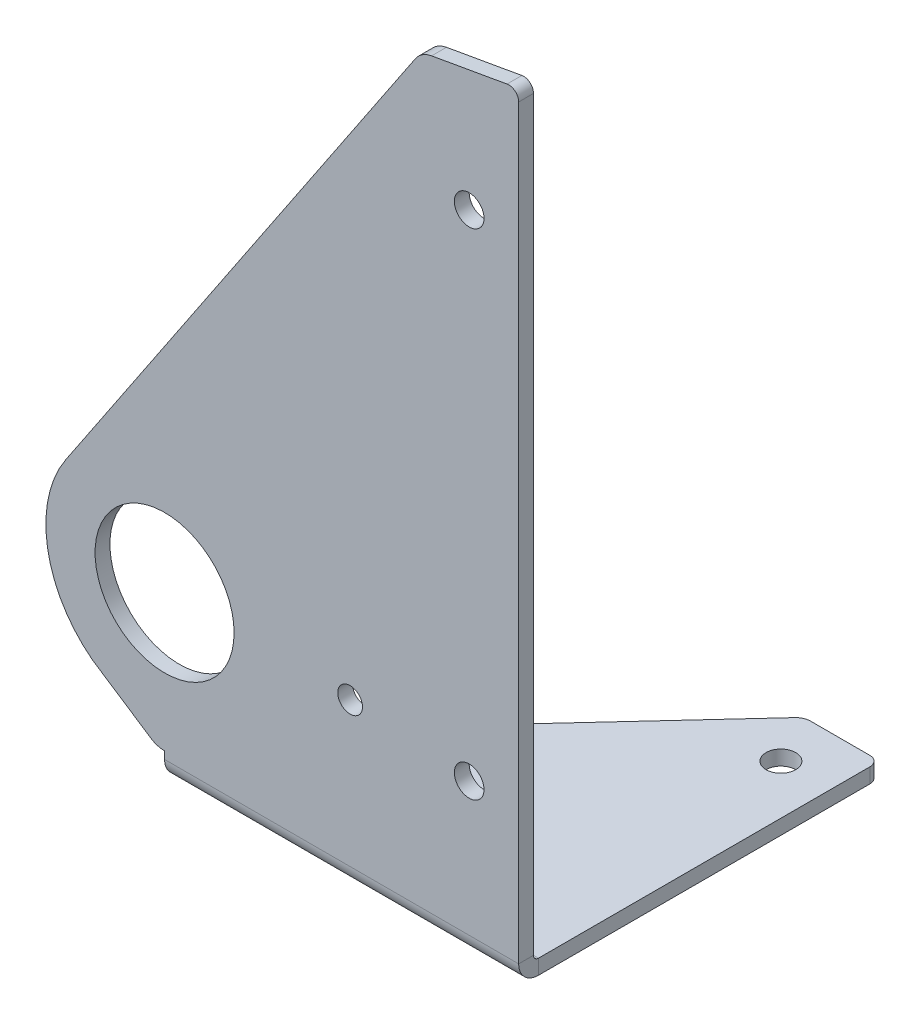
ISO-10303-21;
HEADER;
FILE_DESCRIPTION(('STEP AP214'),'2;1');
FILE_NAME('part.step','',(''),(''),'','','');
FILE_SCHEMA(('AUTOMOTIVE_DESIGN { 1 0 10303 214 1 1 1 1 }'));
ENDSEC;
DATA;
#1=APPLICATION_CONTEXT('core data for automotive mechanical design processes');
#2=APPLICATION_PROTOCOL_DEFINITION('international standard','automotive_design',2000,#1);
#3=PRODUCT_CONTEXT('',#1,'mechanical');
#4=PRODUCT('Part','Part','',(#3));
#5=PRODUCT_RELATED_PRODUCT_CATEGORY('part','',(#4));
#6=PRODUCT_DEFINITION_FORMATION('','',#4);
#7=PRODUCT_DEFINITION_CONTEXT('part definition',#1,'design');
#8=PRODUCT_DEFINITION('design','',#6,#7);
#9=PRODUCT_DEFINITION_SHAPE('','',#8);
#10=(LENGTH_UNIT() NAMED_UNIT(*) SI_UNIT(.MILLI.,.METRE.));
#11=(NAMED_UNIT(*) PLANE_ANGLE_UNIT() SI_UNIT($,.RADIAN.));
#12=(NAMED_UNIT(*) SI_UNIT($,.STERADIAN.) SOLID_ANGLE_UNIT());
#13=UNCERTAINTY_MEASURE_WITH_UNIT(LENGTH_MEASURE(1.E-05),#10,'distance_accuracy_value','');
#14=(GEOMETRIC_REPRESENTATION_CONTEXT(3) GLOBAL_UNCERTAINTY_ASSIGNED_CONTEXT((#13)) GLOBAL_UNIT_ASSIGNED_CONTEXT((#10,
#11,#12)) REPRESENTATION_CONTEXT('',''));
#15=CARTESIAN_POINT('',(0.,0.,0.));
#16=DIRECTION('',(0.,0.,1.));
#17=DIRECTION('',(1.,0.,0.));
#18=AXIS2_PLACEMENT_3D('',#15,#16,#17);
#19=CARTESIAN_POINT('',(0.,0.,3.));
#20=DIRECTION('',(0.,0.,1.));
#21=DIRECTION('',(1.,0.,0.));
#22=AXIS2_PLACEMENT_3D('',#19,#20,#21);
#23=PLANE('',#22);
#24=CARTESIAN_POINT('',(624.785,479.124016715,3.));
#25=DIRECTION('',(0.,0.,1.));
#26=DIRECTION('',(1.,0.,0.));
#27=AXIS2_PLACEMENT_3D('',#24,#25,#26);
#28=CIRCLE('',#27,3.00000000000005);
#29=CARTESIAN_POINT('',(627.785,479.124016715,3.));
#30=VERTEX_POINT('',#29);
#31=EDGE_CURVE('E349',#30,#30,#28,.T.);
#32=ORIENTED_EDGE('',*,*,#31,.F.);
#33=EDGE_LOOP('',(#32));
#34=FACE_BOUND('',#33,.T.);
#35=CARTESIAN_POINT('',(600.715,381.314016715,3.));
#36=DIRECTION('',(0.,0.,1.));
#37=DIRECTION('',(1.,0.,0.));
#38=AXIS2_PLACEMENT_3D('',#35,#36,#37);
#39=CIRCLE('',#38,2.49999999999995);
#40=CARTESIAN_POINT('',(603.215,381.314016715,3.));
#41=VERTEX_POINT('',#40);
#42=EDGE_CURVE('E195',#41,#41,#39,.T.);
#43=ORIENTED_EDGE('',*,*,#42,.F.);
#44=EDGE_LOOP('',(#43));
#45=FACE_BOUND('',#44,.T.);
#46=CARTESIAN_POINT('',(563.215,381.314016715,3.));
#47=DIRECTION('',(0.,0.,1.));
#48=DIRECTION('',(1.,0.,0.));
#49=AXIS2_PLACEMENT_3D('',#46,#47,#48);
#50=CIRCLE('',#49,14.05);
#51=CARTESIAN_POINT('',(577.265,381.314016715,3.));
#52=VERTEX_POINT('',#51);
#53=EDGE_CURVE('E201',#52,#52,#50,.T.);
#54=ORIENTED_EDGE('',*,*,#53,.F.);
#55=EDGE_LOOP('',(#54));
#56=FACE_BOUND('',#55,.T.);
#57=CARTESIAN_POINT('',(624.785,379.124016715,3.));
#58=DIRECTION('',(0.,0.,1.));
#59=DIRECTION('',(1.,0.,0.));
#60=AXIS2_PLACEMENT_3D('',#57,#58,#59);
#61=CIRCLE('',#60,3.);
#62=CARTESIAN_POINT('',(627.785,379.124016715,3.));
#63=VERTEX_POINT('',#62);
#64=EDGE_CURVE('E378',#63,#63,#61,.T.);
#65=ORIENTED_EDGE('',*,*,#64,.F.);
#66=EDGE_LOOP('',(#65));
#67=FACE_BOUND('',#66,.T.);
#68=DIRECTION('',(-0.834861498321892,0.550460060876105,0.));
#69=VECTOR('',#68,1.);
#70=CARTESIAN_POINT('',(332.713886262824,504.614291463374,3.));
#71=LINE('',#70,#69);
#72=CARTESIAN_POINT('',(560.462704086631,354.449709223391,3.));
#73=VERTEX_POINT('',#72);
#74=CARTESIAN_POINT('',(548.655279811411,362.234851427687,3.));
#75=VERTEX_POINT('',#74);
#76=EDGE_CURVE('E179',#73,#75,#71,.T.);
#77=ORIENTED_EDGE('',*,*,#76,.F.);
#78=CARTESIAN_POINT('',(563.215004391011,358.624016715,3.));
#79=DIRECTION('',(0.,0.,1.));
#80=DIRECTION('',(1.,0.,0.));
#81=AXIS2_PLACEMENT_3D('',#78,#79,#80);
#82=CIRCLE('',#81,5.);
#83=CARTESIAN_POINT('',(563.215,353.624016715,3.));
#84=VERTEX_POINT('',#83);
#85=EDGE_CURVE('E58',#73,#84,#82,.T.);
#86=ORIENTED_EDGE('',*,*,#85,.T.);
#87=DIRECTION('',(0.,1.,0.));
#88=VECTOR('',#87,1.);
#89=CARTESIAN_POINT('',(563.215,0.,3.));
#90=LINE('',#89,#88);
#91=CARTESIAN_POINT('',(563.215,352.12401671482,3.));
#92=VERTEX_POINT('',#91);
#93=EDGE_CURVE('E372',#84,#92,#90,.F.);
#94=ORIENTED_EDGE('',*,*,#93,.T.);
#95=DIRECTION('',(1.,0.,0.));
#96=VECTOR('',#95,1.);
#97=CARTESIAN_POINT('',(0.,352.12401671482,3.));
#98=LINE('',#97,#96);
#99=CARTESIAN_POINT('',(634.785,352.12401671482,3.));
#100=VERTEX_POINT('',#99);
#101=EDGE_CURVE('E377',#92,#100,#98,.T.);
#102=ORIENTED_EDGE('',*,*,#101,.T.);
#103=DIRECTION('',(0.,1.,0.));
#104=VECTOR('',#103,1.);
#105=CARTESIAN_POINT('',(634.785,0.,3.));
#106=LINE('',#105,#104);
#107=CARTESIAN_POINT('',(634.785,503.002476101812,3.));
#108=VERTEX_POINT('',#107);
#109=EDGE_CURVE('E479',#100,#108,#106,.T.);
#110=ORIENTED_EDGE('',*,*,#109,.T.);
#111=CARTESIAN_POINT('',(632.785,503.002476101812,3.));
#112=DIRECTION('',(0.,0.,1.));
#113=DIRECTION('',(1.,0.,0.));
#114=AXIS2_PLACEMENT_3D('',#111,#112,#113);
#115=CIRCLE('',#114,2.);
#116=CARTESIAN_POINT('',(632.437703644666,504.972091607836,3.));
#117=VERTEX_POINT('',#116);
#118=EDGE_CURVE('E361',#108,#117,#115,.T.);
#119=ORIENTED_EDGE('',*,*,#118,.T.);
#120=DIRECTION('',(0.984807753012208,0.17364817766693,0.));
#121=VECTOR('',#120,1.);
#122=CARTESIAN_POINT('',(-67.2849833620932,381.59210287472,3.));
#123=LINE('',#122,#121);
#124=CARTESIAN_POINT('',(617.188727256125,502.28328564235,3.));
#125=VERTEX_POINT('',#124);
#126=EDGE_CURVE('E528',#125,#117,#123,.T.);
#127=ORIENTED_EDGE('',*,*,#126,.F.);
#128=CARTESIAN_POINT('',(618.05696814446,497.359246877289,3.));
#129=DIRECTION('',(0.,0.,1.));
#130=DIRECTION('',(1.,0.,0.));
#131=AXIS2_PLACEMENT_3D('',#128,#129,#130);
#132=CIRCLE('',#131,5.);
#133=CARTESIAN_POINT('',(613.902426470754,500.14129351267,3.));
#134=VERTEX_POINT('',#133);
#135=EDGE_CURVE('E338',#125,#134,#132,.T.);
#136=ORIENTED_EDGE('',*,*,#135,.T.);
#137=DIRECTION('',(0.556409327076254,0.830908334741294,0.));
#138=VECTOR('',#137,1.);
#139=CARTESIAN_POINT('',(192.615654844476,-128.983116927977,3.));
#140=LINE('',#139,#138);
#141=CARTESIAN_POINT('',(543.273199966275,394.667840564786,3.));
#142=VERTEX_POINT('',#141);
#143=EDGE_CURVE('E525',#142,#134,#140,.T.);
#144=ORIENTED_EDGE('',*,*,#143,.F.);
#145=CARTESIAN_POINT('',(563.215,381.314016715,3.));
#146=DIRECTION('',(0.,0.,-1.));
#147=DIRECTION('',(-1.,0.,0.));
#148=AXIS2_PLACEMENT_3D('',#145,#146,#147);
#149=CIRCLE('',#148,24.0000000000007);
#150=EDGE_CURVE('E187',#75,#142,#149,.T.);
#151=ORIENTED_EDGE('',*,*,#150,.F.);
#152=EDGE_LOOP('',(#77,#86,#94,#102,#110,#119,#127,#136,#144,#151));
#153=FACE_BOUND('',#152,.T.);
#154=ADVANCED_FACE('F50',(#34,#45,#56,#67,#153),#23,.T.);
#155=CARTESIAN_POINT('',(0.,0.,0.));
#156=DIRECTION('',(0.,0.,1.));
#157=DIRECTION('',(1.,0.,0.));
#158=AXIS2_PLACEMENT_3D('',#155,#156,#157);
#159=PLANE('',#158);
#160=CARTESIAN_POINT('',(600.715,381.314016715,0.));
#161=DIRECTION('',(0.,0.,1.));
#162=DIRECTION('',(1.,0.,0.));
#163=AXIS2_PLACEMENT_3D('',#160,#161,#162);
#164=CIRCLE('',#163,2.49999999999995);
#165=CARTESIAN_POINT('',(603.215,381.314016715,0.));
#166=VERTEX_POINT('',#165);
#167=EDGE_CURVE('E471',#166,#166,#164,.T.);
#168=ORIENTED_EDGE('',*,*,#167,.T.);
#169=EDGE_LOOP('',(#168));
#170=FACE_BOUND('',#169,.T.);
#171=CARTESIAN_POINT('',(563.215,381.314016715,0.));
#172=DIRECTION('',(0.,0.,1.));
#173=DIRECTION('',(1.,0.,0.));
#174=AXIS2_PLACEMENT_3D('',#171,#172,#173);
#175=CIRCLE('',#174,14.05);
#176=CARTESIAN_POINT('',(577.265,381.314016715,0.));
#177=VERTEX_POINT('',#176);
#178=EDGE_CURVE('E477',#177,#177,#175,.T.);
#179=ORIENTED_EDGE('',*,*,#178,.T.);
#180=EDGE_LOOP('',(#179));
#181=FACE_BOUND('',#180,.T.);
#182=CARTESIAN_POINT('',(624.785,379.124016715,0.));
#183=DIRECTION('',(0.,0.,1.));
#184=DIRECTION('',(1.,0.,0.));
#185=AXIS2_PLACEMENT_3D('',#182,#183,#184);
#186=CIRCLE('',#185,3.);
#187=CARTESIAN_POINT('',(627.785,379.124016715,0.));
#188=VERTEX_POINT('',#187);
#189=EDGE_CURVE('E505',#188,#188,#186,.T.);
#190=ORIENTED_EDGE('',*,*,#189,.T.);
#191=EDGE_LOOP('',(#190));
#192=FACE_BOUND('',#191,.T.);
#193=CARTESIAN_POINT('',(624.785,479.124016715,0.));
#194=DIRECTION('',(0.,0.,1.));
#195=DIRECTION('',(1.,0.,0.));
#196=AXIS2_PLACEMENT_3D('',#193,#194,#195);
#197=CIRCLE('',#196,3.00000000000005);
#198=CARTESIAN_POINT('',(627.785,479.124016715,0.));
#199=VERTEX_POINT('',#198);
#200=EDGE_CURVE('E345',#199,#199,#197,.T.);
#201=ORIENTED_EDGE('',*,*,#200,.T.);
#202=EDGE_LOOP('',(#201));
#203=FACE_BOUND('',#202,.T.);
#204=DIRECTION('',(0.,1.,0.));
#205=VECTOR('',#204,1.);
#206=CARTESIAN_POINT('',(563.215,0.,0.));
#207=LINE('',#206,#205);
#208=CARTESIAN_POINT('',(563.215,353.624016715,0.));
#209=VERTEX_POINT('',#208);
#210=CARTESIAN_POINT('',(563.215,352.12401671482,0.));
#211=VERTEX_POINT('',#210);
#212=EDGE_CURVE('E507',#209,#211,#207,.F.);
#213=ORIENTED_EDGE('',*,*,#212,.F.);
#214=CARTESIAN_POINT('',(563.215004391011,358.624016715,0.));
#215=DIRECTION('',(0.,0.,1.));
#216=DIRECTION('',(1.,0.,0.));
#217=AXIS2_PLACEMENT_3D('',#214,#215,#216);
#218=CIRCLE('',#217,5.);
#219=CARTESIAN_POINT('',(560.462704086631,354.449709223391,0.));
#220=VERTEX_POINT('',#219);
#221=EDGE_CURVE('E13',#209,#220,#218,.F.);
#222=ORIENTED_EDGE('',*,*,#221,.T.);
#223=DIRECTION('',(-0.834861498321892,0.550460060876105,0.));
#224=VECTOR('',#223,1.);
#225=CARTESIAN_POINT('',(332.713886262824,504.614291463374,0.));
#226=LINE('',#225,#224);
#227=CARTESIAN_POINT('',(548.655279811411,362.234851427687,0.));
#228=VERTEX_POINT('',#227);
#229=EDGE_CURVE('E171',#220,#228,#226,.T.);
#230=ORIENTED_EDGE('',*,*,#229,.T.);
#231=CARTESIAN_POINT('',(563.215,381.314016715,0.));
#232=DIRECTION('',(0.,0.,-1.));
#233=DIRECTION('',(-1.,0.,0.));
#234=AXIS2_PLACEMENT_3D('',#231,#232,#233);
#235=CIRCLE('',#234,24.0000000000007);
#236=CARTESIAN_POINT('',(543.273199966275,394.667840564786,0.));
#237=VERTEX_POINT('',#236);
#238=EDGE_CURVE('E176',#237,#228,#235,.F.);
#239=ORIENTED_EDGE('',*,*,#238,.F.);
#240=DIRECTION('',(0.556409327076254,0.830908334741294,0.));
#241=VECTOR('',#240,1.);
#242=CARTESIAN_POINT('',(192.615654844476,-128.983116927977,0.));
#243=LINE('',#242,#241);
#244=CARTESIAN_POINT('',(613.902426470754,500.14129351267,0.));
#245=VERTEX_POINT('',#244);
#246=EDGE_CURVE('E526',#237,#245,#243,.T.);
#247=ORIENTED_EDGE('',*,*,#246,.T.);
#248=CARTESIAN_POINT('',(618.05696814446,497.359246877289,0.));
#249=DIRECTION('',(0.,0.,1.));
#250=DIRECTION('',(1.,0.,0.));
#251=AXIS2_PLACEMENT_3D('',#248,#249,#250);
#252=CIRCLE('',#251,5.);
#253=CARTESIAN_POINT('',(617.188727256125,502.28328564235,0.));
#254=VERTEX_POINT('',#253);
#255=EDGE_CURVE('E342',#245,#254,#252,.F.);
#256=ORIENTED_EDGE('',*,*,#255,.T.);
#257=DIRECTION('',(0.984807753012208,0.17364817766693,0.));
#258=VECTOR('',#257,1.);
#259=CARTESIAN_POINT('',(-67.2849833620932,381.59210287472,0.));
#260=LINE('',#259,#258);
#261=CARTESIAN_POINT('',(632.437703644666,504.972091607836,0.));
#262=VERTEX_POINT('',#261);
#263=EDGE_CURVE('E348',#254,#262,#260,.T.);
#264=ORIENTED_EDGE('',*,*,#263,.T.);
#265=CARTESIAN_POINT('',(632.785,503.002476101812,0.));
#266=DIRECTION('',(0.,0.,1.));
#267=DIRECTION('',(1.,0.,0.));
#268=AXIS2_PLACEMENT_3D('',#265,#266,#267);
#269=CIRCLE('',#268,2.);
#270=CARTESIAN_POINT('',(634.785,503.002476101812,0.));
#271=VERTEX_POINT('',#270);
#272=EDGE_CURVE('E365',#262,#271,#269,.F.);
#273=ORIENTED_EDGE('',*,*,#272,.T.);
#274=DIRECTION('',(0.,1.,0.));
#275=VECTOR('',#274,1.);
#276=CARTESIAN_POINT('',(634.785,0.,0.));
#277=LINE('',#276,#275);
#278=CARTESIAN_POINT('',(634.785,352.12401671482,0.));
#279=VERTEX_POINT('',#278);
#280=EDGE_CURVE('E464',#279,#271,#277,.T.);
#281=ORIENTED_EDGE('',*,*,#280,.F.);
#282=DIRECTION('',(1.,0.,0.));
#283=VECTOR('',#282,1.);
#284=CARTESIAN_POINT('',(0.,352.12401671482,0.));
#285=LINE('',#284,#283);
#286=EDGE_CURVE('E207',#211,#279,#285,.T.);
#287=ORIENTED_EDGE('',*,*,#286,.F.);
#288=EDGE_LOOP('',(#213,#222,#230,#239,#247,#256,#264,#273,#281,#287));
#289=FACE_BOUND('',#288,.T.);
#290=ADVANCED_FACE('F173',(#170,#181,#192,#203,#289),#159,.F.);
#291=CARTESIAN_POINT('',(634.785,0.,-456.195747310813));
#292=DIRECTION('',(1.,0.,0.));
#293=DIRECTION('',(0.,0.,-1.));
#294=AXIS2_PLACEMENT_3D('',#291,#292,#293);
#295=PLANE('',#294);
#296=ORIENTED_EDGE('',*,*,#280,.T.);
#297=DIRECTION('',(0.,0.,-1.));
#298=VECTOR('',#297,1.);
#299=CARTESIAN_POINT('',(634.785,503.002476101812,-456.195747310813));
#300=LINE('',#299,#298);
#301=EDGE_CURVE('E358',#271,#108,#300,.F.);
#302=ORIENTED_EDGE('',*,*,#301,.T.);
#303=ORIENTED_EDGE('',*,*,#109,.F.);
#304=DIRECTION('',(0.,0.,-1.));
#305=VECTOR('',#304,1.);
#306=CARTESIAN_POINT('',(634.785,352.124016714824,-456.19574731081));
#307=LINE('',#306,#305);
#308=EDGE_CURVE('E469',#100,#279,#307,.T.);
#309=ORIENTED_EDGE('',*,*,#308,.T.);
#310=EDGE_LOOP('',(#296,#302,#303,#309));
#311=FACE_BOUND('',#310,.T.);
#312=ADVANCED_FACE('F393',(#311),#295,.T.);
#313=CARTESIAN_POINT('',(0.,351.124016714822,-349.197025897833));
#314=DIRECTION('',(0.,-1.,0.));
#315=DIRECTION('',(1.,0.,0.));
#316=AXIS2_PLACEMENT_3D('',#313,#314,#315);
#317=PLANE('',#316);
#318=CARTESIAN_POINT('',(624.795000002,351.124016714821,-60.0000000001796));
#319=DIRECTION('',(0.,-1.,0.));
#320=DIRECTION('',(1.,0.,0.));
#321=AXIS2_PLACEMENT_3D('',#318,#319,#320);
#322=CIRCLE('',#321,3.);
#323=CARTESIAN_POINT('',(627.795000002,351.124016714821,-60.0000000001796));
#324=VERTEX_POINT('',#323);
#325=EDGE_CURVE('E214',#324,#324,#322,.T.);
#326=ORIENTED_EDGE('',*,*,#325,.T.);
#327=EDGE_LOOP('',(#326));
#328=FACE_BOUND('',#327,.T.);
#329=DIRECTION('',(0.,0.,1.));
#330=VECTOR('',#329,1.);
#331=CARTESIAN_POINT('',(634.785,351.124016714822,-349.197025897833));
#332=LINE('',#331,#330);
#333=CARTESIAN_POINT('',(634.785,351.124016714821,-68.0000000001796));
#334=VERTEX_POINT('',#333);
#335=CARTESIAN_POINT('',(634.785,351.12401671482,-1.));
#336=VERTEX_POINT('',#335);
#337=EDGE_CURVE('E318',#334,#336,#332,.T.);
#338=ORIENTED_EDGE('',*,*,#337,.F.);
#339=CARTESIAN_POINT('',(632.785,351.124016714821,-68.0000000001796));
#340=DIRECTION('',(0.,-1.,0.));
#341=DIRECTION('',(0.,0.,-1.));
#342=AXIS2_PLACEMENT_3D('',#339,#340,#341);
#343=CIRCLE('',#342,2.);
#344=CARTESIAN_POINT('',(632.785,351.124016714821,-70.0000000001796));
#345=VERTEX_POINT('',#344);
#346=EDGE_CURVE('E356',#334,#345,#343,.F.);
#347=ORIENTED_EDGE('',*,*,#346,.T.);
#348=DIRECTION('',(1.,0.,0.));
#349=VECTOR('',#348,1.);
#350=CARTESIAN_POINT('',(0.,351.124016714821,-70.0000000001796));
#351=LINE('',#350,#349);
#352=CARTESIAN_POINT('',(620.799090301436,351.124016714821,-70.0000000001796));
#353=VERTEX_POINT('',#352);
#354=EDGE_CURVE('E218',#353,#345,#351,.T.);
#355=ORIENTED_EDGE('',*,*,#354,.F.);
#356=CARTESIAN_POINT('',(620.799090301873,351.124016714821,-67.000000000145));
#357=DIRECTION('',(0.,1.,0.));
#358=DIRECTION('',(0.,0.,1.));
#359=AXIS2_PLACEMENT_3D('',#356,#357,#358);
#360=CIRCLE('',#359,3.00000000003464);
#361=CARTESIAN_POINT('',(618.594000997304,351.124016714821,-69.0341045105096));
#362=VERTEX_POINT('',#361);
#363=EDGE_CURVE('E222',#362,#353,#360,.F.);
#364=ORIENTED_EDGE('',*,*,#363,.F.);
#365=DIRECTION('',(0.678034836890404,0.,-0.7350297680795));
#366=VECTOR('',#365,1.);
#367=CARTESIAN_POINT('',(563.215,351.124016714821,-9.00000000017959));
#368=LINE('',#367,#366);
#369=CARTESIAN_POINT('',(564.539851159602,351.124016714821,-10.4362168250385));
#370=VERTEX_POINT('',#369);
#371=EDGE_CURVE('E225',#370,#362,#368,.T.);
#372=ORIENTED_EDGE('',*,*,#371,.F.);
#373=CARTESIAN_POINT('',(568.215,351.12401671482,-7.04604264058643));
#374=DIRECTION('',(0.,-1.,0.));
#375=DIRECTION('',(0.,0.,-1.));
#376=AXIS2_PLACEMENT_3D('',#373,#374,#375);
#377=CIRCLE('',#376,5.);
#378=CARTESIAN_POINT('',(563.215,351.12401671482,-7.04604264058645));
#379=VERTEX_POINT('',#378);
#380=EDGE_CURVE('E333',#370,#379,#377,.F.);
#381=ORIENTED_EDGE('',*,*,#380,.T.);
#382=DIRECTION('',(0.,0.,1.));
#383=VECTOR('',#382,1.);
#384=CARTESIAN_POINT('',(563.215,351.124016714822,-349.197025897833));
#385=LINE('',#384,#383);
#386=CARTESIAN_POINT('',(563.215,351.12401671482,-1.));
#387=VERTEX_POINT('',#386);
#388=EDGE_CURVE('E300',#387,#379,#385,.F.);
#389=ORIENTED_EDGE('',*,*,#388,.F.);
#390=DIRECTION('',(1.,0.,0.));
#391=VECTOR('',#390,1.);
#392=CARTESIAN_POINT('',(0.,351.12401671482,-1.));
#393=LINE('',#392,#391);
#394=EDGE_CURVE('E308',#387,#336,#393,.T.);
#395=ORIENTED_EDGE('',*,*,#394,.T.);
#396=EDGE_LOOP('',(#338,#347,#355,#364,#372,#381,#389,#395));
#397=FACE_BOUND('',#396,.T.);
#398=ADVANCED_FACE('F403',(#328,#397),#317,.F.);
#399=CARTESIAN_POINT('',(0.,348.124016714822,-349.197025897833));
#400=DIRECTION('',(0.,-1.,0.));
#401=DIRECTION('',(1.,0.,0.));
#402=AXIS2_PLACEMENT_3D('',#399,#400,#401);
#403=PLANE('',#402);
#404=DIRECTION('',(1.,0.,0.));
#405=VECTOR('',#404,1.);
#406=CARTESIAN_POINT('',(0.,348.124016714821,-70.0000000001796));
#407=LINE('',#406,#405);
#408=CARTESIAN_POINT('',(620.799090301436,348.124016714821,-70.0000000001796));
#409=VERTEX_POINT('',#408);
#410=CARTESIAN_POINT('',(632.785,348.124016714821,-70.0000000001796));
#411=VERTEX_POINT('',#410);
#412=EDGE_CURVE('E228',#409,#411,#407,.T.);
#413=ORIENTED_EDGE('',*,*,#412,.T.);
#414=CARTESIAN_POINT('',(632.785,348.124016714821,-68.0000000001796));
#415=DIRECTION('',(0.,-1.,0.));
#416=DIRECTION('',(0.,0.,-1.));
#417=AXIS2_PLACEMENT_3D('',#414,#415,#416);
#418=CIRCLE('',#417,2.);
#419=CARTESIAN_POINT('',(634.785,348.124016714821,-68.0000000001796));
#420=VERTEX_POINT('',#419);
#421=EDGE_CURVE('E352',#411,#420,#418,.T.);
#422=ORIENTED_EDGE('',*,*,#421,.T.);
#423=DIRECTION('',(0.,0.,1.));
#424=VECTOR('',#423,1.);
#425=CARTESIAN_POINT('',(634.785,348.124016714822,-349.197025897833));
#426=LINE('',#425,#424);
#427=CARTESIAN_POINT('',(634.785,348.12401671482,-0.999999999999964));
#428=VERTEX_POINT('',#427);
#429=EDGE_CURVE('E305',#420,#428,#426,.T.);
#430=ORIENTED_EDGE('',*,*,#429,.T.);
#431=DIRECTION('',(1.,0.,0.));
#432=VECTOR('',#431,1.);
#433=CARTESIAN_POINT('',(0.,348.12401671482,-1.));
#434=LINE('',#433,#432);
#435=CARTESIAN_POINT('',(563.215,348.12401671482,-1.));
#436=VERTEX_POINT('',#435);
#437=EDGE_CURVE('E301',#436,#428,#434,.T.);
#438=ORIENTED_EDGE('',*,*,#437,.F.);
#439=DIRECTION('',(0.,0.,1.));
#440=VECTOR('',#439,1.);
#441=CARTESIAN_POINT('',(563.215,348.124016714822,-349.197025897833));
#442=LINE('',#441,#440);
#443=CARTESIAN_POINT('',(563.215,348.12401671482,-7.04604264058645));
#444=VERTEX_POINT('',#443);
#445=EDGE_CURVE('E321',#436,#444,#442,.F.);
#446=ORIENTED_EDGE('',*,*,#445,.T.);
#447=CARTESIAN_POINT('',(568.215,348.12401671482,-7.04604264058644));
#448=DIRECTION('',(0.,-1.,0.));
#449=DIRECTION('',(0.,0.,-1.));
#450=AXIS2_PLACEMENT_3D('',#447,#448,#449);
#451=CIRCLE('',#450,5.);
#452=CARTESIAN_POINT('',(564.539851159602,348.124016714821,-10.4362168250385));
#453=VERTEX_POINT('',#452);
#454=EDGE_CURVE('E329',#444,#453,#451,.T.);
#455=ORIENTED_EDGE('',*,*,#454,.T.);
#456=DIRECTION('',(0.678034836890404,0.,-0.7350297680795));
#457=VECTOR('',#456,1.);
#458=CARTESIAN_POINT('',(474.29043682995,348.124016714821,87.3994731348823));
#459=LINE('',#458,#457);
#460=CARTESIAN_POINT('',(618.594000997304,348.124016714821,-69.0341045105096));
#461=VERTEX_POINT('',#460);
#462=EDGE_CURVE('E232',#453,#461,#459,.T.);
#463=ORIENTED_EDGE('',*,*,#462,.T.);
#464=CARTESIAN_POINT('',(620.799090301873,348.124016714821,-67.000000000145));
#465=DIRECTION('',(0.,1.,0.));
#466=DIRECTION('',(0.,0.,1.));
#467=AXIS2_PLACEMENT_3D('',#464,#465,#466);
#468=CIRCLE('',#467,3.00000000003464);
#469=EDGE_CURVE('E235',#409,#461,#468,.T.);
#470=ORIENTED_EDGE('',*,*,#469,.F.);
#471=EDGE_LOOP('',(#413,#422,#430,#438,#446,#455,#463,#470));
#472=FACE_BOUND('',#471,.T.);
#473=CARTESIAN_POINT('',(624.795000002,348.124016714821,-60.0000000001796));
#474=DIRECTION('',(0.,-1.,0.));
#475=DIRECTION('',(1.,0.,0.));
#476=AXIS2_PLACEMENT_3D('',#473,#474,#475);
#477=CIRCLE('',#476,3.);
#478=CARTESIAN_POINT('',(627.795000002,348.124016714821,-60.0000000001796));
#479=VERTEX_POINT('',#478);
#480=EDGE_CURVE('E211',#479,#479,#477,.T.);
#481=ORIENTED_EDGE('',*,*,#480,.F.);
#482=EDGE_LOOP('',(#481));
#483=FACE_BOUND('',#482,.T.);
#484=ADVANCED_FACE('F426',(#472,#483),#403,.T.);
#485=CARTESIAN_POINT('',(563.215,807.319764025635,-349.197025897832));
#486=DIRECTION('',(-1.,0.,0.));
#487=DIRECTION('',(0.,-1.,0.));
#488=AXIS2_PLACEMENT_3D('',#485,#486,#487);
#489=PLANE('',#488);
#490=ORIENTED_EDGE('',*,*,#388,.T.);
#491=DIRECTION('',(0.,-1.,0.));
#492=VECTOR('',#491,1.);
#493=CARTESIAN_POINT('',(563.215,807.319764025633,-7.04604264058484));
#494=LINE('',#493,#492);
#495=EDGE_CURVE('E314',#379,#444,#494,.T.);
#496=ORIENTED_EDGE('',*,*,#495,.T.);
#497=ORIENTED_EDGE('',*,*,#445,.F.);
#498=DIRECTION('',(0.,-1.,0.));
#499=VECTOR('',#498,1.);
#500=CARTESIAN_POINT('',(563.215,807.319764025631,-0.999999999995171));
#501=LINE('',#500,#499);
#502=EDGE_CURVE('E311',#387,#436,#501,.T.);
#503=ORIENTED_EDGE('',*,*,#502,.F.);
#504=EDGE_LOOP('',(#490,#496,#497,#503));
#505=FACE_BOUND('',#504,.T.);
#506=ADVANCED_FACE('F429',(#505),#489,.T.);
#507=CARTESIAN_POINT('',(634.785,807.319764025635,-349.197025897832));
#508=DIRECTION('',(1.,0.,0.));
#509=DIRECTION('',(0.,1.,0.));
#510=AXIS2_PLACEMENT_3D('',#507,#508,#509);
#511=PLANE('',#510);
#512=ORIENTED_EDGE('',*,*,#429,.F.);
#513=DIRECTION('',(0.,-1.,0.));
#514=VECTOR('',#513,1.);
#515=CARTESIAN_POINT('',(634.785,807.319764025634,-68.000000000178));
#516=LINE('',#515,#514);
#517=EDGE_CURVE('E354',#420,#334,#516,.F.);
#518=ORIENTED_EDGE('',*,*,#517,.T.);
#519=ORIENTED_EDGE('',*,*,#337,.T.);
#520=DIRECTION('',(0.,1.,0.));
#521=VECTOR('',#520,1.);
#522=CARTESIAN_POINT('',(634.785,807.319764025631,-0.999999999995171));
#523=LINE('',#522,#521);
#524=EDGE_CURVE('E304',#428,#336,#523,.T.);
#525=ORIENTED_EDGE('',*,*,#524,.F.);
#526=EDGE_LOOP('',(#512,#518,#519,#525));
#527=FACE_BOUND('',#526,.T.);
#528=ADVANCED_FACE('F424',(#527),#511,.T.);
#529=CARTESIAN_POINT('',(0.,546.953238913418,-70.0000000001789));
#530=DIRECTION('',(0.,0.,-1.));
#531=DIRECTION('',(0.,1.,0.));
#532=AXIS2_PLACEMENT_3D('',#529,#530,#531);
#533=PLANE('',#532);
#534=ORIENTED_EDGE('',*,*,#354,.T.);
#535=DIRECTION('',(0.,-1.,0.));
#536=VECTOR('',#535,1.);
#537=CARTESIAN_POINT('',(632.785,546.953238913418,-70.0000000001789));
#538=LINE('',#537,#536);
#539=EDGE_CURVE('E344',#345,#411,#538,.T.);
#540=ORIENTED_EDGE('',*,*,#539,.T.);
#541=ORIENTED_EDGE('',*,*,#412,.F.);
#542=DIRECTION('',(0.,-1.,0.));
#543=VECTOR('',#542,1.);
#544=CARTESIAN_POINT('',(620.799090301436,546.953238913418,-70.0000000001789));
#545=LINE('',#544,#543);
#546=EDGE_CURVE('E243',#353,#409,#545,.T.);
#547=ORIENTED_EDGE('',*,*,#546,.F.);
#548=EDGE_LOOP('',(#534,#540,#541,#547));
#549=FACE_BOUND('',#548,.T.);
#550=ADVANCED_FACE('F420',(#549),#533,.T.);
#551=CARTESIAN_POINT('',(620.799090301873,546.953238913418,-67.0000000001443));
#552=DIRECTION('',(0.,-1.,0.));
#553=DIRECTION('',(1.,0.,0.));
#554=AXIS2_PLACEMENT_3D('',#551,#552,#553);
#555=CYLINDRICAL_SURFACE('',#554,3.00000000003464);
#556=ORIENTED_EDGE('',*,*,#546,.T.);
#557=ORIENTED_EDGE('',*,*,#469,.T.);
#558=DIRECTION('',(0.,-1.,0.));
#559=VECTOR('',#558,1.);
#560=CARTESIAN_POINT('',(618.594000997304,546.953238913418,-69.034104510509));
#561=LINE('',#560,#559);
#562=EDGE_CURVE('E239',#362,#461,#561,.T.);
#563=ORIENTED_EDGE('',*,*,#562,.F.);
#564=ORIENTED_EDGE('',*,*,#363,.T.);
#565=EDGE_LOOP('',(#556,#557,#563,#564));
#566=FACE_BOUND('',#565,.T.);
#567=ADVANCED_FACE('F416',(#566),#555,.T.);
#568=CARTESIAN_POINT('',(563.215,546.953238913418,-9.00000000017892));
#569=DIRECTION('',(-0.7350297680795,0.,-0.678034836890404));
#570=DIRECTION('',(0.678034836890404,0.,-0.7350297680795));
#571=AXIS2_PLACEMENT_3D('',#568,#569,#570);
#572=PLANE('',#571);
#573=ORIENTED_EDGE('',*,*,#462,.F.);
#574=DIRECTION('',(0.,-1.,0.));
#575=VECTOR('',#574,1.);
#576=CARTESIAN_POINT('',(564.539851159602,546.953238913418,-10.4362168250378));
#577=LINE('',#576,#575);
#578=EDGE_CURVE('E331',#453,#370,#577,.F.);
#579=ORIENTED_EDGE('',*,*,#578,.T.);
#580=ORIENTED_EDGE('',*,*,#371,.T.);
#581=ORIENTED_EDGE('',*,*,#562,.T.);
#582=EDGE_LOOP('',(#573,#579,#580,#581));
#583=FACE_BOUND('',#582,.T.);
#584=ADVANCED_FACE('F412',(#583),#572,.T.);
#585=CARTESIAN_POINT('',(624.795000002,348.124016714821,-60.0000000001796));
#586=DIRECTION('',(0.,-1.,0.));
#587=DIRECTION('',(1.,0.,0.));
#588=AXIS2_PLACEMENT_3D('',#585,#586,#587);
#589=CYLINDRICAL_SURFACE('',#588,3.);
#590=ORIENTED_EDGE('',*,*,#325,.F.);
#591=EDGE_LOOP('',(#590));
#592=FACE_BOUND('',#591,.T.);
#593=ORIENTED_EDGE('',*,*,#480,.T.);
#594=EDGE_LOOP('',(#593));
#595=FACE_BOUND('',#594,.T.);
#596=ADVANCED_FACE('F409',(#592,#595),#589,.F.);
#597=CARTESIAN_POINT('',(563.215,381.314016715,-456.195747310813));
#598=DIRECTION('',(0.,0.,1.));
#599=DIRECTION('',(1.,0.,0.));
#600=AXIS2_PLACEMENT_3D('',#597,#598,#599);
#601=CYLINDRICAL_SURFACE('',#600,24.0000000000007);
#602=DIRECTION('',(0.,0.,1.));
#603=VECTOR('',#602,1.);
#604=CARTESIAN_POINT('',(548.655279811411,362.234851427687,-456.195747310813));
#605=LINE('',#604,#603);
#606=EDGE_CURVE('E182',#228,#75,#605,.T.);
#607=ORIENTED_EDGE('',*,*,#606,.T.);
#608=ORIENTED_EDGE('',*,*,#150,.T.);
#609=DIRECTION('',(0.,0.,-1.));
#610=VECTOR('',#609,1.);
#611=CARTESIAN_POINT('',(543.273199966275,394.667840564786,0.));
#612=LINE('',#611,#610);
#613=EDGE_CURVE('E193',#237,#142,#612,.F.);
#614=ORIENTED_EDGE('',*,*,#613,.F.);
#615=ORIENTED_EDGE('',*,*,#238,.T.);
#616=EDGE_LOOP('',(#607,#608,#614,#615));
#617=FACE_BOUND('',#616,.T.);
#618=ADVANCED_FACE('F191',(#617),#601,.T.);
#619=CARTESIAN_POINT('',(600.715,381.314016715,3.));
#620=DIRECTION('',(0.,0.,1.));
#621=DIRECTION('',(1.,0.,0.));
#622=AXIS2_PLACEMENT_3D('',#619,#620,#621);
#623=CYLINDRICAL_SURFACE('',#622,2.49999999999995);
#624=ORIENTED_EDGE('',*,*,#167,.F.);
#625=EDGE_LOOP('',(#624));
#626=FACE_BOUND('',#625,.T.);
#627=ORIENTED_EDGE('',*,*,#42,.T.);
#628=EDGE_LOOP('',(#627));
#629=FACE_BOUND('',#628,.T.);
#630=ADVANCED_FACE('F501',(#626,#629),#623,.F.);
#631=CARTESIAN_POINT('',(563.215,381.314016715,3.));
#632=DIRECTION('',(0.,0.,1.));
#633=DIRECTION('',(1.,0.,0.));
#634=AXIS2_PLACEMENT_3D('',#631,#632,#633);
#635=CYLINDRICAL_SURFACE('',#634,14.05);
#636=ORIENTED_EDGE('',*,*,#178,.F.);
#637=EDGE_LOOP('',(#636));
#638=FACE_BOUND('',#637,.T.);
#639=ORIENTED_EDGE('',*,*,#53,.T.);
#640=EDGE_LOOP('',(#639));
#641=FACE_BOUND('',#640,.T.);
#642=ADVANCED_FACE('F490',(#638,#641),#635,.F.);
#643=CARTESIAN_POINT('',(624.785,379.124016715,3.));
#644=DIRECTION('',(0.,0.,1.));
#645=DIRECTION('',(1.,0.,0.));
#646=AXIS2_PLACEMENT_3D('',#643,#644,#645);
#647=CYLINDRICAL_SURFACE('',#646,3.);
#648=ORIENTED_EDGE('',*,*,#189,.F.);
#649=EDGE_LOOP('',(#648));
#650=FACE_BOUND('',#649,.T.);
#651=ORIENTED_EDGE('',*,*,#64,.T.);
#652=EDGE_LOOP('',(#651));
#653=FACE_BOUND('',#652,.T.);
#654=ADVANCED_FACE('F400',(#650,#653),#647,.F.);
#655=CARTESIAN_POINT('',(563.215,0.,-456.195747310813));
#656=DIRECTION('',(-1.,0.,0.));
#657=DIRECTION('',(0.,0.,1.));
#658=AXIS2_PLACEMENT_3D('',#655,#656,#657);
#659=PLANE('',#658);
#660=ORIENTED_EDGE('',*,*,#212,.T.);
#661=DIRECTION('',(0.,0.,1.));
#662=VECTOR('',#661,1.);
#663=CARTESIAN_POINT('',(563.215,352.124016714824,-456.19574731081));
#664=LINE('',#663,#662);
#665=EDGE_CURVE('E215',#211,#92,#664,.T.);
#666=ORIENTED_EDGE('',*,*,#665,.T.);
#667=ORIENTED_EDGE('',*,*,#93,.F.);
#668=DIRECTION('',(0.,0.,1.));
#669=VECTOR('',#668,1.);
#670=CARTESIAN_POINT('',(563.215,353.624016715,-456.195747310813));
#671=LINE('',#670,#669);
#672=EDGE_CURVE('E188',#209,#84,#671,.T.);
#673=ORIENTED_EDGE('',*,*,#672,.F.);
#674=EDGE_LOOP('',(#660,#666,#667,#673));
#675=FACE_BOUND('',#674,.T.);
#676=ADVANCED_FACE('F376',(#675),#659,.T.);
#677=CARTESIAN_POINT('',(563.215,352.12401671482,-1.));
#678=DIRECTION('',(-1.,0.,0.));
#679=DIRECTION('',(0.,0.,1.));
#680=AXIS2_PLACEMENT_3D('',#677,#678,#679);
#681=PLANE('',#680);
#682=ORIENTED_EDGE('',*,*,#665,.F.);
#683=CARTESIAN_POINT('',(563.215,352.12401671482,-1.));
#684=DIRECTION('',(1.,0.,0.));
#685=DIRECTION('',(0.,0.,-1.));
#686=AXIS2_PLACEMENT_3D('',#683,#684,#685);
#687=CIRCLE('',#686,1.);
#688=EDGE_CURVE('E517',#211,#387,#687,.T.);
#689=ORIENTED_EDGE('',*,*,#688,.T.);
#690=ORIENTED_EDGE('',*,*,#502,.T.);
#691=CARTESIAN_POINT('',(563.215,352.12401671482,-1.));
#692=DIRECTION('',(1.,0.,0.));
#693=DIRECTION('',(0.,0.,-1.));
#694=AXIS2_PLACEMENT_3D('',#691,#692,#693);
#695=CIRCLE('',#694,4.);
#696=EDGE_CURVE('E516',#92,#436,#695,.T.);
#697=ORIENTED_EDGE('',*,*,#696,.F.);
#698=EDGE_LOOP('',(#682,#689,#690,#697));
#699=FACE_BOUND('',#698,.T.);
#700=ADVANCED_FACE('F408',(#699),#681,.T.);
#701=CARTESIAN_POINT('',(634.785,352.12401671482,-1.));
#702=DIRECTION('',(1.,0.,0.));
#703=DIRECTION('',(0.,0.,-1.));
#704=AXIS2_PLACEMENT_3D('',#701,#702,#703);
#705=PLANE('',#704);
#706=CARTESIAN_POINT('',(634.785,352.12401671482,-1.));
#707=DIRECTION('',(1.,0.,0.));
#708=DIRECTION('',(0.,0.,-1.));
#709=AXIS2_PLACEMENT_3D('',#706,#707,#708);
#710=CIRCLE('',#709,1.);
#711=EDGE_CURVE('E514',#336,#279,#710,.F.);
#712=ORIENTED_EDGE('',*,*,#711,.T.);
#713=ORIENTED_EDGE('',*,*,#308,.F.);
#714=CARTESIAN_POINT('',(634.785,352.12401671482,-1.));
#715=DIRECTION('',(-1.,0.,0.));
#716=DIRECTION('',(0.,0.,1.));
#717=AXIS2_PLACEMENT_3D('',#714,#715,#716);
#718=CIRCLE('',#717,4.);
#719=EDGE_CURVE('E210',#428,#100,#718,.T.);
#720=ORIENTED_EDGE('',*,*,#719,.F.);
#721=ORIENTED_EDGE('',*,*,#524,.T.);
#722=EDGE_LOOP('',(#712,#713,#720,#721));
#723=FACE_BOUND('',#722,.T.);
#724=ADVANCED_FACE('F556',(#723),#705,.T.);
#725=CARTESIAN_POINT('',(527.259591882422,352.12401671482,-1.));
#726=DIRECTION('',(1.,0.,0.));
#727=DIRECTION('',(0.,0.,-1.));
#728=AXIS2_PLACEMENT_3D('',#725,#726,#727);
#729=CYLINDRICAL_SURFACE('',#728,4.);
#730=ORIENTED_EDGE('',*,*,#437,.T.);
#731=ORIENTED_EDGE('',*,*,#719,.T.);
#732=ORIENTED_EDGE('',*,*,#101,.F.);
#733=ORIENTED_EDGE('',*,*,#696,.T.);
#734=EDGE_LOOP('',(#730,#731,#732,#733));
#735=FACE_BOUND('',#734,.T.);
#736=ADVANCED_FACE('F553',(#735),#729,.T.);
#737=CARTESIAN_POINT('',(527.259591882422,352.12401671482,-1.));
#738=DIRECTION('',(1.,0.,0.));
#739=DIRECTION('',(0.,0.,-1.));
#740=AXIS2_PLACEMENT_3D('',#737,#738,#739);
#741=CYLINDRICAL_SURFACE('',#740,1.);
#742=ORIENTED_EDGE('',*,*,#394,.F.);
#743=ORIENTED_EDGE('',*,*,#688,.F.);
#744=ORIENTED_EDGE('',*,*,#286,.T.);
#745=ORIENTED_EDGE('',*,*,#711,.F.);
#746=EDGE_LOOP('',(#742,#743,#744,#745));
#747=FACE_BOUND('',#746,.T.);
#748=ADVANCED_FACE('F548',(#747),#741,.F.);
#749=CARTESIAN_POINT('',(-67.2849833620932,381.59210287472,0.));
#750=DIRECTION('',(0.17364817766693,-0.984807753012208,0.));
#751=DIRECTION('',(0.984807753012208,0.17364817766693,0.));
#752=AXIS2_PLACEMENT_3D('',#749,#750,#751);
#753=PLANE('',#752);
#754=ORIENTED_EDGE('',*,*,#126,.T.);
#755=DIRECTION('',(0.,0.,1.));
#756=VECTOR('',#755,1.);
#757=CARTESIAN_POINT('',(632.437703644666,504.972091607836,0.));
#758=LINE('',#757,#756);
#759=EDGE_CURVE('E363',#117,#262,#758,.F.);
#760=ORIENTED_EDGE('',*,*,#759,.T.);
#761=ORIENTED_EDGE('',*,*,#263,.F.);
#762=DIRECTION('',(0.,0.,-1.));
#763=VECTOR('',#762,1.);
#764=CARTESIAN_POINT('',(617.188727256125,502.28328564235,0.));
#765=LINE('',#764,#763);
#766=EDGE_CURVE('E335',#254,#125,#765,.F.);
#767=ORIENTED_EDGE('',*,*,#766,.T.);
#768=EDGE_LOOP('',(#754,#760,#761,#767));
#769=FACE_BOUND('',#768,.T.);
#770=ADVANCED_FACE('F545',(#769),#753,.F.);
#771=CARTESIAN_POINT('',(192.615654844476,-128.983116927977,0.));
#772=DIRECTION('',(0.830908334741294,-0.556409327076254,0.));
#773=DIRECTION('',(0.556409327076254,0.830908334741294,0.));
#774=AXIS2_PLACEMENT_3D('',#771,#772,#773);
#775=PLANE('',#774);
#776=ORIENTED_EDGE('',*,*,#143,.T.);
#777=DIRECTION('',(0.,0.,-1.));
#778=VECTOR('',#777,1.);
#779=CARTESIAN_POINT('',(613.902426470754,500.14129351267,0.));
#780=LINE('',#779,#778);
#781=EDGE_CURVE('E340',#134,#245,#780,.T.);
#782=ORIENTED_EDGE('',*,*,#781,.T.);
#783=ORIENTED_EDGE('',*,*,#246,.F.);
#784=ORIENTED_EDGE('',*,*,#613,.T.);
#785=EDGE_LOOP('',(#776,#782,#783,#784));
#786=FACE_BOUND('',#785,.T.);
#787=ADVANCED_FACE('F444',(#786),#775,.F.);
#788=CARTESIAN_POINT('',(568.215,807.319764025633,-7.04604264058484));
#789=DIRECTION('',(0.,-1.,0.));
#790=DIRECTION('',(0.,0.,-1.));
#791=AXIS2_PLACEMENT_3D('',#788,#789,#790);
#792=CYLINDRICAL_SURFACE('',#791,5.);
#793=ORIENTED_EDGE('',*,*,#380,.F.);
#794=ORIENTED_EDGE('',*,*,#578,.F.);
#795=ORIENTED_EDGE('',*,*,#454,.F.);
#796=ORIENTED_EDGE('',*,*,#495,.F.);
#797=EDGE_LOOP('',(#793,#794,#795,#796));
#798=FACE_BOUND('',#797,.T.);
#799=ADVANCED_FACE('F440',(#798),#792,.T.);
#800=CARTESIAN_POINT('',(618.05696814446,497.359246877289,0.));
#801=DIRECTION('',(0.,0.,1.));
#802=DIRECTION('',(1.,0.,0.));
#803=AXIS2_PLACEMENT_3D('',#800,#801,#802);
#804=CYLINDRICAL_SURFACE('',#803,5.);
#805=ORIENTED_EDGE('',*,*,#255,.F.);
#806=ORIENTED_EDGE('',*,*,#781,.F.);
#807=ORIENTED_EDGE('',*,*,#135,.F.);
#808=ORIENTED_EDGE('',*,*,#766,.F.);
#809=EDGE_LOOP('',(#805,#806,#807,#808));
#810=FACE_BOUND('',#809,.T.);
#811=ADVANCED_FACE('F443',(#810),#804,.T.);
#812=CARTESIAN_POINT('',(624.785,479.124016715,-7.));
#813=DIRECTION('',(0.,0.,1.));
#814=DIRECTION('',(1.,0.,0.));
#815=AXIS2_PLACEMENT_3D('',#812,#813,#814);
#816=CYLINDRICAL_SURFACE('',#815,3.00000000000005);
#817=ORIENTED_EDGE('',*,*,#31,.T.);
#818=EDGE_LOOP('',(#817));
#819=FACE_BOUND('',#818,.T.);
#820=ORIENTED_EDGE('',*,*,#200,.F.);
#821=EDGE_LOOP('',(#820));
#822=FACE_BOUND('',#821,.T.);
#823=ADVANCED_FACE('F448',(#819,#822),#816,.F.);
#824=CARTESIAN_POINT('',(632.785,546.953238913418,-68.0000000001789));
#825=DIRECTION('',(0.,-1.,0.));
#826=DIRECTION('',(0.,0.,-1.));
#827=AXIS2_PLACEMENT_3D('',#824,#825,#826);
#828=CYLINDRICAL_SURFACE('',#827,2.);
#829=ORIENTED_EDGE('',*,*,#346,.F.);
#830=ORIENTED_EDGE('',*,*,#517,.F.);
#831=ORIENTED_EDGE('',*,*,#421,.F.);
#832=ORIENTED_EDGE('',*,*,#539,.F.);
#833=EDGE_LOOP('',(#829,#830,#831,#832));
#834=FACE_BOUND('',#833,.T.);
#835=ADVANCED_FACE('F450',(#834),#828,.T.);
#836=CARTESIAN_POINT('',(632.785,503.002476101812,-456.195747310813));
#837=DIRECTION('',(0.,0.,-1.));
#838=DIRECTION('',(-1.,0.,0.));
#839=AXIS2_PLACEMENT_3D('',#836,#837,#838);
#840=CYLINDRICAL_SURFACE('',#839,2.);
#841=ORIENTED_EDGE('',*,*,#272,.F.);
#842=ORIENTED_EDGE('',*,*,#759,.F.);
#843=ORIENTED_EDGE('',*,*,#118,.F.);
#844=ORIENTED_EDGE('',*,*,#301,.F.);
#845=EDGE_LOOP('',(#841,#842,#843,#844));
#846=FACE_BOUND('',#845,.T.);
#847=ADVANCED_FACE('F384',(#846),#840,.T.);
#848=CARTESIAN_POINT('',(332.713886262824,504.614291463374,0.));
#849=DIRECTION('',(0.550460060876105,0.834861498321892,0.));
#850=DIRECTION('',(-0.834861498321892,0.550460060876105,0.));
#851=AXIS2_PLACEMENT_3D('',#848,#849,#850);
#852=PLANE('',#851);
#853=ORIENTED_EDGE('',*,*,#229,.F.);
#854=DIRECTION('',(0.,0.,1.));
#855=VECTOR('',#854,1.);
#856=CARTESIAN_POINT('',(560.462704086631,354.449709223391,0.));
#857=LINE('',#856,#855);
#858=EDGE_CURVE('E367',#220,#73,#857,.T.);
#859=ORIENTED_EDGE('',*,*,#858,.T.);
#860=ORIENTED_EDGE('',*,*,#76,.T.);
#861=ORIENTED_EDGE('',*,*,#606,.F.);
#862=EDGE_LOOP('',(#853,#859,#860,#861));
#863=FACE_BOUND('',#862,.T.);
#864=ADVANCED_FACE('F183',(#863),#852,.F.);
#865=CARTESIAN_POINT('',(563.215004391011,358.624016715,0.));
#866=DIRECTION('',(0.,0.,-1.));
#867=DIRECTION('',(-1.,0.,0.));
#868=AXIS2_PLACEMENT_3D('',#865,#866,#867);
#869=CYLINDRICAL_SURFACE('',#868,5.);
#870=ORIENTED_EDGE('',*,*,#221,.F.);
#871=ORIENTED_EDGE('',*,*,#672,.T.);
#872=ORIENTED_EDGE('',*,*,#85,.F.);
#873=ORIENTED_EDGE('',*,*,#858,.F.);
#874=EDGE_LOOP('',(#870,#871,#872,#873));
#875=FACE_BOUND('',#874,.T.);
#876=ADVANCED_FACE('F52',(#875),#869,.T.);
#877=CLOSED_SHELL('',(#154,#290,#312,#398,#484,#506,#528,#550,#567,#584,#596,#618,#630,#642,
#654,#676,#700,#724,#736,#748,#770,#787,#799,#811,#823,#835,#847,#864,#876));
#878=MANIFOLD_SOLID_BREP('B2',#877);
#879=ADVANCED_BREP_SHAPE_REPRESENTATION('',(#18,#878),#14);
#880=SHAPE_DEFINITION_REPRESENTATION(#9,#879);
ENDSEC;
END-ISO-10303-21;
